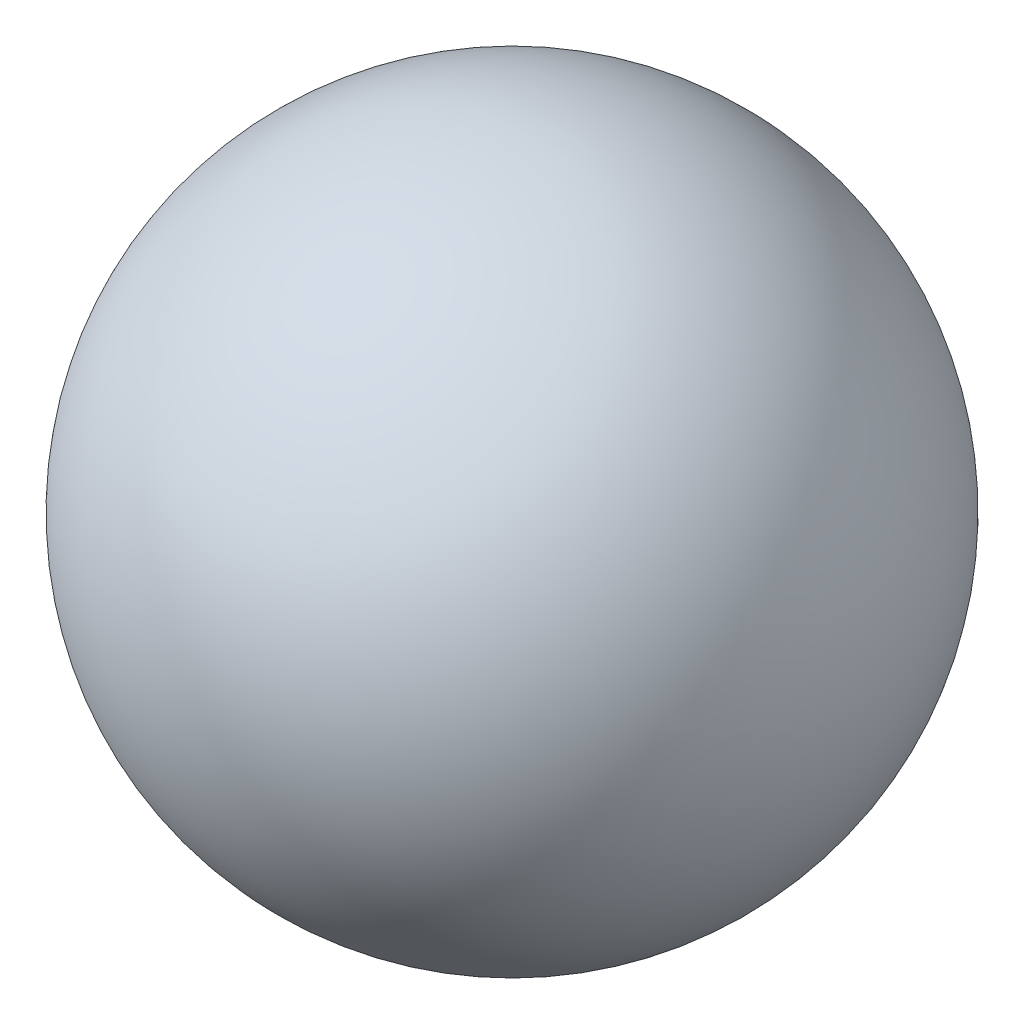
ISO-10303-21;
HEADER;
FILE_DESCRIPTION(('STEP AP214'),'2;1');
FILE_NAME('part.step','',(''),(''),'','','');
FILE_SCHEMA(('AUTOMOTIVE_DESIGN { 1 0 10303 214 1 1 1 1 }'));
ENDSEC;
DATA;
#1=APPLICATION_CONTEXT('core data for automotive mechanical design processes');
#2=APPLICATION_PROTOCOL_DEFINITION('international standard','automotive_design',2000,#1);
#3=PRODUCT_CONTEXT('',#1,'mechanical');
#4=PRODUCT('Part','Part','',(#3));
#5=PRODUCT_RELATED_PRODUCT_CATEGORY('part','',(#4));
#6=PRODUCT_DEFINITION_FORMATION('','',#4);
#7=PRODUCT_DEFINITION_CONTEXT('part definition',#1,'design');
#8=PRODUCT_DEFINITION('design','',#6,#7);
#9=PRODUCT_DEFINITION_SHAPE('','',#8);
#10=(LENGTH_UNIT() NAMED_UNIT(*) SI_UNIT(.MILLI.,.METRE.));
#11=(NAMED_UNIT(*) PLANE_ANGLE_UNIT() SI_UNIT($,.RADIAN.));
#12=(NAMED_UNIT(*) SI_UNIT($,.STERADIAN.) SOLID_ANGLE_UNIT());
#13=UNCERTAINTY_MEASURE_WITH_UNIT(LENGTH_MEASURE(1.E-05),#10,'distance_accuracy_value','');
#14=(GEOMETRIC_REPRESENTATION_CONTEXT(3) GLOBAL_UNCERTAINTY_ASSIGNED_CONTEXT((#13)) GLOBAL_UNIT_ASSIGNED_CONTEXT((#10,
#11,#12)) REPRESENTATION_CONTEXT('',''));
#15=CARTESIAN_POINT('',(0.,0.,0.));
#16=DIRECTION('',(0.,0.,1.));
#17=DIRECTION('',(1.,0.,0.));
#18=AXIS2_PLACEMENT_3D('',#15,#16,#17);
#19=CARTESIAN_POINT('',(57.535,-39.2468327179377,47.3899948708608));
#20=DIRECTION('',(0.,-0.637833186545712,0.770174542646628));
#21=DIRECTION('',(0.173648177666934,-0.758473860771031,-0.628143067238699));
#22=AXIS2_PLACEMENT_3D('',#19,#20,#21);
#23=SPHERICAL_SURFACE('',#22,6.75);
#24=CARTESIAN_POINT('',(57.535,-43.5522067271212,52.5886730337255));
#25=VERTEX_POINT('',#24);
#26=VERTEX_LOOP('',#25);
#27=FACE_BOUND('',#26,.T.);
#28=CARTESIAN_POINT('',(57.535,-34.9414587087541,42.1913167079961));
#29=VERTEX_POINT('',#28);
#30=VERTEX_LOOP('',#29);
#31=FACE_BOUND('',#30,.T.);
#32=ADVANCED_FACE('F16',(#27,#31),#23,.T.);
#33=CLOSED_SHELL('',(#32));
#34=MANIFOLD_SOLID_BREP('B1',#33);
#35=ADVANCED_BREP_SHAPE_REPRESENTATION('',(#18,#34),#14);
#36=SHAPE_DEFINITION_REPRESENTATION(#9,#35);
ENDSEC;
END-ISO-10303-21;
